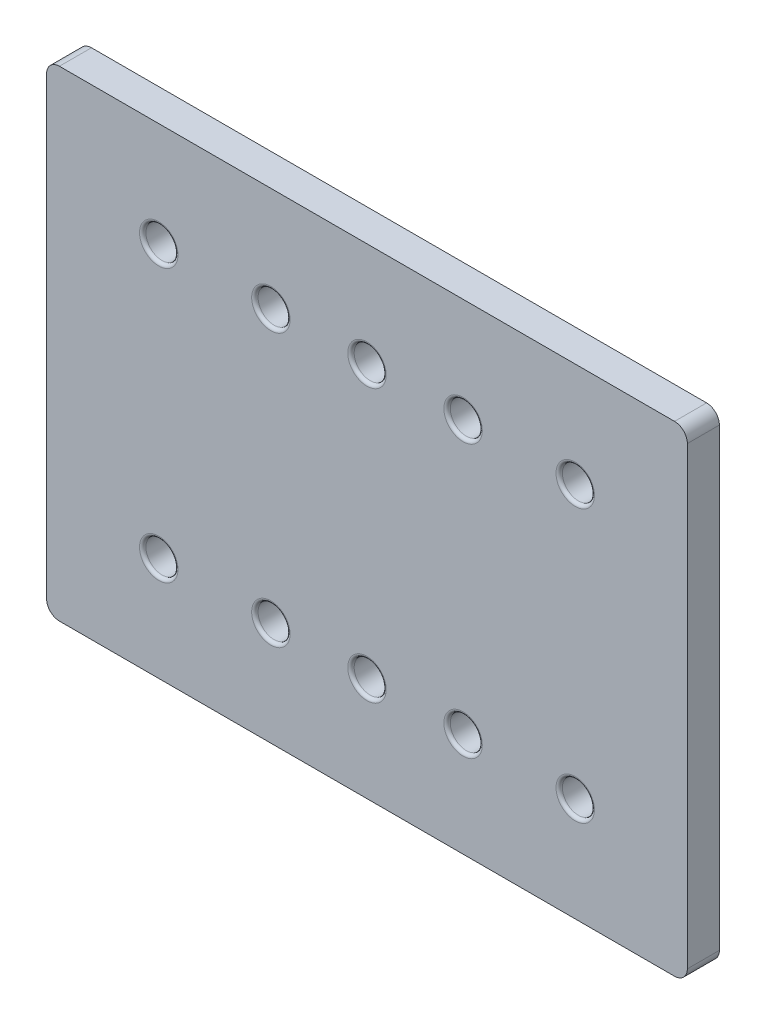
ISO-10303-21;
HEADER;
FILE_DESCRIPTION(('STEP AP214'),'2;1');
FILE_NAME('part.step','',(''),(''),'','','');
FILE_SCHEMA(('AUTOMOTIVE_DESIGN { 1 0 10303 214 1 1 1 1 }'));
ENDSEC;
DATA;
#1=APPLICATION_CONTEXT('core data for automotive mechanical design processes');
#2=APPLICATION_PROTOCOL_DEFINITION('international standard','automotive_design',2000,#1);
#3=PRODUCT_CONTEXT('',#1,'mechanical');
#4=PRODUCT('Part','Part','',(#3));
#5=PRODUCT_RELATED_PRODUCT_CATEGORY('part','',(#4));
#6=PRODUCT_DEFINITION_FORMATION('','',#4);
#7=PRODUCT_DEFINITION_CONTEXT('part definition',#1,'design');
#8=PRODUCT_DEFINITION('design','',#6,#7);
#9=PRODUCT_DEFINITION_SHAPE('','',#8);
#10=(LENGTH_UNIT() NAMED_UNIT(*) SI_UNIT(.MILLI.,.METRE.));
#11=(NAMED_UNIT(*) PLANE_ANGLE_UNIT() SI_UNIT($,.RADIAN.));
#12=(NAMED_UNIT(*) SI_UNIT($,.STERADIAN.) SOLID_ANGLE_UNIT());
#13=UNCERTAINTY_MEASURE_WITH_UNIT(LENGTH_MEASURE(1.E-05),#10,'distance_accuracy_value','');
#14=(GEOMETRIC_REPRESENTATION_CONTEXT(3) GLOBAL_UNCERTAINTY_ASSIGNED_CONTEXT((#13)) GLOBAL_UNIT_ASSIGNED_CONTEXT((#10,
#11,#12)) REPRESENTATION_CONTEXT('',''));
#15=CARTESIAN_POINT('',(0.,0.,0.));
#16=DIRECTION('',(0.,0.,1.));
#17=DIRECTION('',(1.,0.,0.));
#18=AXIS2_PLACEMENT_3D('',#15,#16,#17);
#19=CARTESIAN_POINT('',(250.,6.11266741651055E-13,1898.));
#20=DIRECTION('',(-1.,0.,0.));
#21=DIRECTION('',(0.,0.,1.));
#22=AXIS2_PLACEMENT_3D('',#19,#20,#21);
#23=PLANE('',#22);
#24=DIRECTION('',(0.,1.,0.));
#25=VECTOR('',#24,1.);
#26=CARTESIAN_POINT('',(250.,6.11266741651055E-13,1898.));
#27=LINE('',#26,#25);
#28=CARTESIAN_POINT('',(250.,86.9999999999996,1898.));
#29=VERTEX_POINT('',#28);
#30=CARTESIAN_POINT('',(250.,157.999999999999,1898.));
#31=VERTEX_POINT('',#30);
#32=EDGE_CURVE('E126',#29,#31,#27,.T.);
#33=ORIENTED_EDGE('',*,*,#32,.F.);
#34=DIRECTION('',(0.,0.,-1.));
#35=VECTOR('',#34,1.);
#36=CARTESIAN_POINT('',(250.,86.9999999999996,1893.));
#37=LINE('',#36,#35);
#38=CARTESIAN_POINT('',(250.,86.9999999999996,1893.));
#39=VERTEX_POINT('',#38);
#40=EDGE_CURVE('E110',#29,#39,#37,.T.);
#41=ORIENTED_EDGE('',*,*,#40,.T.);
#42=DIRECTION('',(0.,1.,0.));
#43=VECTOR('',#42,1.);
#44=CARTESIAN_POINT('',(250.,6.11266741651055E-13,1893.));
#45=LINE('',#44,#43);
#46=CARTESIAN_POINT('',(250.,157.999999999999,1893.));
#47=VERTEX_POINT('',#46);
#48=EDGE_CURVE('E123',#39,#47,#45,.T.);
#49=ORIENTED_EDGE('',*,*,#48,.T.);
#50=DIRECTION('',(0.,0.,-1.));
#51=VECTOR('',#50,1.);
#52=CARTESIAN_POINT('',(250.,157.999999999999,1898.));
#53=LINE('',#52,#51);
#54=EDGE_CURVE('E129',#47,#31,#53,.F.);
#55=ORIENTED_EDGE('',*,*,#54,.T.);
#56=EDGE_LOOP('',(#33,#41,#49,#55));
#57=FACE_BOUND('',#56,.T.);
#58=ADVANCED_FACE('F38',(#57),#23,.F.);
#59=CARTESIAN_POINT('',(215.,159.999999999999,1898.));
#60=DIRECTION('',(0.,-1.,0.));
#61=DIRECTION('',(0.,0.,-1.));
#62=AXIS2_PLACEMENT_3D('',#59,#60,#61);
#63=PLANE('',#62);
#64=DIRECTION('',(-1.,0.,0.));
#65=VECTOR('',#64,1.);
#66=CARTESIAN_POINT('',(215.,159.999999999999,1898.));
#67=LINE('',#66,#65);
#68=CARTESIAN_POINT('',(248.,159.999999999999,1898.));
#69=VERTEX_POINT('',#68);
#70=CARTESIAN_POINT('',(152.,159.999999999999,1898.));
#71=VERTEX_POINT('',#70);
#72=EDGE_CURVE('E495',#69,#71,#67,.T.);
#73=ORIENTED_EDGE('',*,*,#72,.F.);
#74=DIRECTION('',(0.,0.,-1.));
#75=VECTOR('',#74,1.);
#76=CARTESIAN_POINT('',(248.,159.999999999999,1898.));
#77=LINE('',#76,#75);
#78=CARTESIAN_POINT('',(248.,159.999999999999,1893.));
#79=VERTEX_POINT('',#78);
#80=EDGE_CURVE('E184',#69,#79,#77,.T.);
#81=ORIENTED_EDGE('',*,*,#80,.T.);
#82=DIRECTION('',(-1.,0.,0.));
#83=VECTOR('',#82,1.);
#84=CARTESIAN_POINT('',(215.,159.999999999999,1893.));
#85=LINE('',#84,#83);
#86=CARTESIAN_POINT('',(152.,159.999999999999,1893.));
#87=VERTEX_POINT('',#86);
#88=EDGE_CURVE('E135',#79,#87,#85,.T.);
#89=ORIENTED_EDGE('',*,*,#88,.T.);
#90=DIRECTION('',(0.,0.,-1.));
#91=VECTOR('',#90,1.);
#92=CARTESIAN_POINT('',(152.,159.999999999999,1898.));
#93=LINE('',#92,#91);
#94=EDGE_CURVE('E181',#87,#71,#93,.F.);
#95=ORIENTED_EDGE('',*,*,#94,.T.);
#96=EDGE_LOOP('',(#73,#81,#89,#95));
#97=FACE_BOUND('',#96,.T.);
#98=ADVANCED_FACE('F364',(#97),#63,.F.);
#99=CARTESIAN_POINT('',(150.,6.11266741651055E-13,1898.));
#100=DIRECTION('',(-1.,0.,0.));
#101=DIRECTION('',(0.,0.,1.));
#102=AXIS2_PLACEMENT_3D('',#99,#100,#101);
#103=PLANE('',#102);
#104=DIRECTION('',(0.,1.,0.));
#105=VECTOR('',#104,1.);
#106=CARTESIAN_POINT('',(150.,6.11266741651055E-13,1893.));
#107=LINE('',#106,#105);
#108=CARTESIAN_POINT('',(150.,86.9999999999996,1893.));
#109=VERTEX_POINT('',#108);
#110=CARTESIAN_POINT('',(150.,157.999999999999,1893.));
#111=VERTEX_POINT('',#110);
#112=EDGE_CURVE('E139',#109,#111,#107,.T.);
#113=ORIENTED_EDGE('',*,*,#112,.F.);
#114=DIRECTION('',(0.,0.,-1.));
#115=VECTOR('',#114,1.);
#116=CARTESIAN_POINT('',(150.,86.9999999999996,1898.));
#117=LINE('',#116,#115);
#118=CARTESIAN_POINT('',(150.,86.9999999999996,1898.));
#119=VERTEX_POINT('',#118);
#120=EDGE_CURVE('E61',#109,#119,#117,.F.);
#121=ORIENTED_EDGE('',*,*,#120,.T.);
#122=DIRECTION('',(0.,1.,0.));
#123=VECTOR('',#122,1.);
#124=CARTESIAN_POINT('',(150.,6.11266741651055E-13,1898.));
#125=LINE('',#124,#123);
#126=CARTESIAN_POINT('',(150.,157.999999999999,1898.));
#127=VERTEX_POINT('',#126);
#128=EDGE_CURVE('E493',#119,#127,#125,.T.);
#129=ORIENTED_EDGE('',*,*,#128,.T.);
#130=DIRECTION('',(0.,0.,-1.));
#131=VECTOR('',#130,1.);
#132=CARTESIAN_POINT('',(150.,157.999999999999,1893.));
#133=LINE('',#132,#131);
#134=EDGE_CURVE('E175',#127,#111,#133,.T.);
#135=ORIENTED_EDGE('',*,*,#134,.T.);
#136=EDGE_LOOP('',(#113,#121,#129,#135));
#137=FACE_BOUND('',#136,.T.);
#138=ADVANCED_FACE('F369',(#137),#103,.T.);
#139=CARTESIAN_POINT('',(215.,84.9999999999996,1898.));
#140=DIRECTION('',(0.,-1.,0.));
#141=DIRECTION('',(0.,0.,-1.));
#142=AXIS2_PLACEMENT_3D('',#139,#140,#141);
#143=PLANE('',#142);
#144=DIRECTION('',(-1.,0.,0.));
#145=VECTOR('',#144,1.);
#146=CARTESIAN_POINT('',(215.,84.9999999999996,1893.));
#147=LINE('',#146,#145);
#148=CARTESIAN_POINT('',(248.,84.9999999999996,1893.));
#149=VERTEX_POINT('',#148);
#150=CARTESIAN_POINT('',(152.,84.9999999999996,1893.));
#151=VERTEX_POINT('',#150);
#152=EDGE_CURVE('E148',#149,#151,#147,.T.);
#153=ORIENTED_EDGE('',*,*,#152,.F.);
#154=DIRECTION('',(0.,0.,-1.));
#155=VECTOR('',#154,1.);
#156=CARTESIAN_POINT('',(248.,84.9999999999996,1898.));
#157=LINE('',#156,#155);
#158=CARTESIAN_POINT('',(248.,84.9999999999996,1898.));
#159=VERTEX_POINT('',#158);
#160=EDGE_CURVE('E111',#149,#159,#157,.F.);
#161=ORIENTED_EDGE('',*,*,#160,.T.);
#162=DIRECTION('',(-1.,0.,0.));
#163=VECTOR('',#162,1.);
#164=CARTESIAN_POINT('',(215.,84.9999999999996,1898.));
#165=LINE('',#164,#163);
#166=CARTESIAN_POINT('',(152.,84.9999999999996,1898.));
#167=VERTEX_POINT('',#166);
#168=EDGE_CURVE('E142',#159,#167,#165,.T.);
#169=ORIENTED_EDGE('',*,*,#168,.T.);
#170=DIRECTION('',(0.,0.,-1.));
#171=VECTOR('',#170,1.);
#172=CARTESIAN_POINT('',(152.,84.9999999999996,1898.));
#173=LINE('',#172,#171);
#174=EDGE_CURVE('E117',#167,#151,#173,.T.);
#175=ORIENTED_EDGE('',*,*,#174,.T.);
#176=EDGE_LOOP('',(#153,#161,#169,#175));
#177=FACE_BOUND('',#176,.T.);
#178=ADVANCED_FACE('F474',(#177),#143,.T.);
#179=CARTESIAN_POINT('',(0.,0.,1898.));
#180=DIRECTION('',(0.,0.,1.));
#181=DIRECTION('',(1.,0.,0.));
#182=AXIS2_PLACEMENT_3D('',#179,#180,#181);
#183=PLANE('',#182);
#184=CARTESIAN_POINT('',(215.,143.749999999999,1898.));
#185=DIRECTION('',(0.,0.,1.));
#186=DIRECTION('',(1.,0.,0.));
#187=AXIS2_PLACEMENT_3D('',#184,#185,#186);
#188=CIRCLE('',#187,3.00000000000003);
#189=CARTESIAN_POINT('',(218.,143.749999999999,1898.));
#190=VERTEX_POINT('',#189);
#191=EDGE_CURVE('E11',#190,#190,#188,.F.);
#192=ORIENTED_EDGE('',*,*,#191,.T.);
#193=EDGE_LOOP('',(#192));
#194=FACE_BOUND('',#193,.T.);
#195=CARTESIAN_POINT('',(185.,143.749999999999,1898.));
#196=DIRECTION('',(0.,0.,1.));
#197=DIRECTION('',(1.,0.,0.));
#198=AXIS2_PLACEMENT_3D('',#195,#196,#197);
#199=CIRCLE('',#198,3.00000000000003);
#200=CARTESIAN_POINT('',(188.,143.749999999999,1898.));
#201=VERTEX_POINT('',#200);
#202=EDGE_CURVE('E47',#201,#201,#199,.F.);
#203=ORIENTED_EDGE('',*,*,#202,.T.);
#204=EDGE_LOOP('',(#203));
#205=FACE_BOUND('',#204,.T.);
#206=CARTESIAN_POINT('',(185.,101.249999999999,1898.));
#207=DIRECTION('',(0.,0.,1.));
#208=DIRECTION('',(1.,0.,0.));
#209=AXIS2_PLACEMENT_3D('',#206,#207,#208);
#210=CIRCLE('',#209,3.00000000000003);
#211=CARTESIAN_POINT('',(188.,101.249999999999,1898.));
#212=VERTEX_POINT('',#211);
#213=EDGE_CURVE('E336',#212,#212,#210,.F.);
#214=ORIENTED_EDGE('',*,*,#213,.T.);
#215=EDGE_LOOP('',(#214));
#216=FACE_BOUND('',#215,.T.);
#217=CARTESIAN_POINT('',(215.,101.249999999999,1898.));
#218=DIRECTION('',(0.,0.,1.));
#219=DIRECTION('',(1.,0.,0.));
#220=AXIS2_PLACEMENT_3D('',#217,#218,#219);
#221=CIRCLE('',#220,3.00000000000003);
#222=CARTESIAN_POINT('',(218.,101.249999999999,1898.));
#223=VERTEX_POINT('',#222);
#224=EDGE_CURVE('E332',#223,#223,#221,.F.);
#225=ORIENTED_EDGE('',*,*,#224,.T.);
#226=EDGE_LOOP('',(#225));
#227=FACE_BOUND('',#226,.T.);
#228=CARTESIAN_POINT('',(200.,101.249999999999,1898.));
#229=DIRECTION('',(0.,0.,1.));
#230=DIRECTION('',(1.,0.,0.));
#231=AXIS2_PLACEMENT_3D('',#228,#229,#230);
#232=CIRCLE('',#231,3.00000000000003);
#233=CARTESIAN_POINT('',(203.,101.249999999999,1898.));
#234=VERTEX_POINT('',#233);
#235=EDGE_CURVE('E328',#234,#234,#232,.F.);
#236=ORIENTED_EDGE('',*,*,#235,.T.);
#237=EDGE_LOOP('',(#236));
#238=FACE_BOUND('',#237,.T.);
#239=CARTESIAN_POINT('',(232.5,101.249999999999,1898.));
#240=DIRECTION('',(0.,0.,1.));
#241=DIRECTION('',(1.,0.,0.));
#242=AXIS2_PLACEMENT_3D('',#239,#240,#241);
#243=CIRCLE('',#242,2.99999999999991);
#244=CARTESIAN_POINT('',(235.5,101.249999999999,1898.));
#245=VERTEX_POINT('',#244);
#246=EDGE_CURVE('E324',#245,#245,#243,.F.);
#247=ORIENTED_EDGE('',*,*,#246,.T.);
#248=EDGE_LOOP('',(#247));
#249=FACE_BOUND('',#248,.T.);
#250=CARTESIAN_POINT('',(200.,143.749999999999,1898.));
#251=DIRECTION('',(0.,0.,1.));
#252=DIRECTION('',(1.,0.,0.));
#253=AXIS2_PLACEMENT_3D('',#250,#251,#252);
#254=CIRCLE('',#253,3.00000000000003);
#255=CARTESIAN_POINT('',(203.,143.749999999999,1898.));
#256=VERTEX_POINT('',#255);
#257=EDGE_CURVE('E320',#256,#256,#254,.F.);
#258=ORIENTED_EDGE('',*,*,#257,.T.);
#259=EDGE_LOOP('',(#258));
#260=FACE_BOUND('',#259,.T.);
#261=CARTESIAN_POINT('',(167.5,101.249999999999,1898.));
#262=DIRECTION('',(0.,0.,1.));
#263=DIRECTION('',(1.,0.,0.));
#264=AXIS2_PLACEMENT_3D('',#261,#262,#263);
#265=CIRCLE('',#264,2.99999999999991);
#266=CARTESIAN_POINT('',(170.5,101.249999999999,1898.));
#267=VERTEX_POINT('',#266);
#268=EDGE_CURVE('E316',#267,#267,#265,.F.);
#269=ORIENTED_EDGE('',*,*,#268,.T.);
#270=EDGE_LOOP('',(#269));
#271=FACE_BOUND('',#270,.T.);
#272=CARTESIAN_POINT('',(232.5,143.749999999999,1898.));
#273=DIRECTION('',(0.,0.,1.));
#274=DIRECTION('',(1.,0.,0.));
#275=AXIS2_PLACEMENT_3D('',#272,#273,#274);
#276=CIRCLE('',#275,2.99999999999991);
#277=CARTESIAN_POINT('',(235.5,143.749999999999,1898.));
#278=VERTEX_POINT('',#277);
#279=EDGE_CURVE('E312',#278,#278,#276,.F.);
#280=ORIENTED_EDGE('',*,*,#279,.T.);
#281=EDGE_LOOP('',(#280));
#282=FACE_BOUND('',#281,.T.);
#283=CARTESIAN_POINT('',(167.5,143.749999999999,1898.));
#284=DIRECTION('',(0.,0.,1.));
#285=DIRECTION('',(1.,0.,0.));
#286=AXIS2_PLACEMENT_3D('',#283,#284,#285);
#287=CIRCLE('',#286,2.99999999999991);
#288=CARTESIAN_POINT('',(170.5,143.749999999999,1898.));
#289=VERTEX_POINT('',#288);
#290=EDGE_CURVE('E308',#289,#289,#287,.F.);
#291=ORIENTED_EDGE('',*,*,#290,.T.);
#292=EDGE_LOOP('',(#291));
#293=FACE_BOUND('',#292,.T.);
#294=ORIENTED_EDGE('',*,*,#168,.F.);
#295=CARTESIAN_POINT('',(248.,86.9999999999996,1898.));
#296=DIRECTION('',(0.,0.,1.));
#297=DIRECTION('',(1.,0.,0.));
#298=AXIS2_PLACEMENT_3D('',#295,#296,#297);
#299=CIRCLE('',#298,2.);
#300=EDGE_CURVE('E172',#159,#29,#299,.T.);
#301=ORIENTED_EDGE('',*,*,#300,.T.);
#302=ORIENTED_EDGE('',*,*,#32,.T.);
#303=CARTESIAN_POINT('',(248.,157.999999999999,1898.));
#304=DIRECTION('',(0.,0.,1.));
#305=DIRECTION('',(1.,0.,0.));
#306=AXIS2_PLACEMENT_3D('',#303,#304,#305);
#307=CIRCLE('',#306,2.);
#308=EDGE_CURVE('E166',#31,#69,#307,.T.);
#309=ORIENTED_EDGE('',*,*,#308,.T.);
#310=ORIENTED_EDGE('',*,*,#72,.T.);
#311=CARTESIAN_POINT('',(152.,157.999999999999,1898.));
#312=DIRECTION('',(0.,0.,1.));
#313=DIRECTION('',(1.,0.,0.));
#314=AXIS2_PLACEMENT_3D('',#311,#312,#313);
#315=CIRCLE('',#314,2.);
#316=EDGE_CURVE('E54',#71,#127,#315,.T.);
#317=ORIENTED_EDGE('',*,*,#316,.T.);
#318=ORIENTED_EDGE('',*,*,#128,.F.);
#319=CARTESIAN_POINT('',(152.,86.9999999999996,1898.));
#320=DIRECTION('',(0.,0.,1.));
#321=DIRECTION('',(1.,0.,0.));
#322=AXIS2_PLACEMENT_3D('',#319,#320,#321);
#323=CIRCLE('',#322,2.);
#324=EDGE_CURVE('E169',#119,#167,#323,.T.);
#325=ORIENTED_EDGE('',*,*,#324,.T.);
#326=EDGE_LOOP('',(#294,#301,#302,#309,#310,#317,#318,#325));
#327=FACE_BOUND('',#326,.T.);
#328=ADVANCED_FACE('F343',(#194,#205,#216,#227,#238,#249,#260,#271,#282,#293,#327),#183,.T.);
#329=CARTESIAN_POINT('',(0.,0.,1893.));
#330=DIRECTION('',(0.,0.,1.));
#331=DIRECTION('',(1.,0.,0.));
#332=AXIS2_PLACEMENT_3D('',#329,#330,#331);
#333=PLANE('',#332);
#334=CARTESIAN_POINT('',(215.,143.749999999999,1893.));
#335=DIRECTION('',(0.,0.,1.));
#336=DIRECTION('',(1.,0.,0.));
#337=AXIS2_PLACEMENT_3D('',#334,#335,#336);
#338=CIRCLE('',#337,3.00000000000003);
#339=CARTESIAN_POINT('',(218.,143.749999999999,1893.));
#340=VERTEX_POINT('',#339);
#341=EDGE_CURVE('E232',#340,#340,#338,.T.);
#342=ORIENTED_EDGE('',*,*,#341,.T.);
#343=EDGE_LOOP('',(#342));
#344=FACE_BOUND('',#343,.T.);
#345=CARTESIAN_POINT('',(185.,143.749999999999,1893.));
#346=DIRECTION('',(0.,0.,1.));
#347=DIRECTION('',(1.,0.,0.));
#348=AXIS2_PLACEMENT_3D('',#345,#346,#347);
#349=CIRCLE('',#348,3.00000000000003);
#350=CARTESIAN_POINT('',(188.,143.749999999999,1893.));
#351=VERTEX_POINT('',#350);
#352=EDGE_CURVE('E228',#351,#351,#349,.T.);
#353=ORIENTED_EDGE('',*,*,#352,.T.);
#354=EDGE_LOOP('',(#353));
#355=FACE_BOUND('',#354,.T.);
#356=CARTESIAN_POINT('',(185.,101.249999999999,1893.));
#357=DIRECTION('',(0.,0.,1.));
#358=DIRECTION('',(1.,0.,0.));
#359=AXIS2_PLACEMENT_3D('',#356,#357,#358);
#360=CIRCLE('',#359,3.00000000000003);
#361=CARTESIAN_POINT('',(188.,101.249999999999,1893.));
#362=VERTEX_POINT('',#361);
#363=EDGE_CURVE('E224',#362,#362,#360,.T.);
#364=ORIENTED_EDGE('',*,*,#363,.T.);
#365=EDGE_LOOP('',(#364));
#366=FACE_BOUND('',#365,.T.);
#367=CARTESIAN_POINT('',(215.,101.249999999999,1893.));
#368=DIRECTION('',(0.,0.,1.));
#369=DIRECTION('',(1.,0.,0.));
#370=AXIS2_PLACEMENT_3D('',#367,#368,#369);
#371=CIRCLE('',#370,3.00000000000003);
#372=CARTESIAN_POINT('',(218.,101.249999999999,1893.));
#373=VERTEX_POINT('',#372);
#374=EDGE_CURVE('E220',#373,#373,#371,.T.);
#375=ORIENTED_EDGE('',*,*,#374,.T.);
#376=EDGE_LOOP('',(#375));
#377=FACE_BOUND('',#376,.T.);
#378=CARTESIAN_POINT('',(200.,101.249999999999,1893.));
#379=DIRECTION('',(0.,0.,1.));
#380=DIRECTION('',(1.,0.,0.));
#381=AXIS2_PLACEMENT_3D('',#378,#379,#380);
#382=CIRCLE('',#381,3.00000000000003);
#383=CARTESIAN_POINT('',(203.,101.249999999999,1893.));
#384=VERTEX_POINT('',#383);
#385=EDGE_CURVE('E216',#384,#384,#382,.T.);
#386=ORIENTED_EDGE('',*,*,#385,.T.);
#387=EDGE_LOOP('',(#386));
#388=FACE_BOUND('',#387,.T.);
#389=CARTESIAN_POINT('',(232.5,101.249999999999,1893.));
#390=DIRECTION('',(0.,0.,1.));
#391=DIRECTION('',(1.,0.,0.));
#392=AXIS2_PLACEMENT_3D('',#389,#390,#391);
#393=CIRCLE('',#392,2.99999999999991);
#394=CARTESIAN_POINT('',(235.5,101.249999999999,1893.));
#395=VERTEX_POINT('',#394);
#396=EDGE_CURVE('E212',#395,#395,#393,.T.);
#397=ORIENTED_EDGE('',*,*,#396,.T.);
#398=EDGE_LOOP('',(#397));
#399=FACE_BOUND('',#398,.T.);
#400=CARTESIAN_POINT('',(200.,143.749999999999,1893.));
#401=DIRECTION('',(0.,0.,1.));
#402=DIRECTION('',(1.,0.,0.));
#403=AXIS2_PLACEMENT_3D('',#400,#401,#402);
#404=CIRCLE('',#403,3.00000000000003);
#405=CARTESIAN_POINT('',(203.,143.749999999999,1893.));
#406=VERTEX_POINT('',#405);
#407=EDGE_CURVE('E208',#406,#406,#404,.T.);
#408=ORIENTED_EDGE('',*,*,#407,.T.);
#409=EDGE_LOOP('',(#408));
#410=FACE_BOUND('',#409,.T.);
#411=CARTESIAN_POINT('',(167.5,101.249999999999,1893.));
#412=DIRECTION('',(0.,0.,1.));
#413=DIRECTION('',(1.,0.,0.));
#414=AXIS2_PLACEMENT_3D('',#411,#412,#413);
#415=CIRCLE('',#414,2.99999999999991);
#416=CARTESIAN_POINT('',(170.5,101.249999999999,1893.));
#417=VERTEX_POINT('',#416);
#418=EDGE_CURVE('E204',#417,#417,#415,.T.);
#419=ORIENTED_EDGE('',*,*,#418,.T.);
#420=EDGE_LOOP('',(#419));
#421=FACE_BOUND('',#420,.T.);
#422=CARTESIAN_POINT('',(167.5,143.749999999999,1893.));
#423=DIRECTION('',(0.,0.,1.));
#424=DIRECTION('',(1.,0.,0.));
#425=AXIS2_PLACEMENT_3D('',#422,#423,#424);
#426=CIRCLE('',#425,2.99999999999991);
#427=CARTESIAN_POINT('',(170.5,143.749999999999,1893.));
#428=VERTEX_POINT('',#427);
#429=EDGE_CURVE('E200',#428,#428,#426,.T.);
#430=ORIENTED_EDGE('',*,*,#429,.T.);
#431=EDGE_LOOP('',(#430));
#432=FACE_BOUND('',#431,.T.);
#433=CARTESIAN_POINT('',(232.5,143.749999999999,1893.));
#434=DIRECTION('',(0.,0.,1.));
#435=DIRECTION('',(1.,0.,0.));
#436=AXIS2_PLACEMENT_3D('',#433,#434,#435);
#437=CIRCLE('',#436,2.99999999999991);
#438=CARTESIAN_POINT('',(235.5,143.749999999999,1893.));
#439=VERTEX_POINT('',#438);
#440=EDGE_CURVE('E196',#439,#439,#437,.T.);
#441=ORIENTED_EDGE('',*,*,#440,.T.);
#442=EDGE_LOOP('',(#441));
#443=FACE_BOUND('',#442,.T.);
#444=ORIENTED_EDGE('',*,*,#48,.F.);
#445=CARTESIAN_POINT('',(248.,86.9999999999996,1893.));
#446=DIRECTION('',(0.,0.,1.));
#447=DIRECTION('',(1.,0.,0.));
#448=AXIS2_PLACEMENT_3D('',#445,#446,#447);
#449=CIRCLE('',#448,2.);
#450=EDGE_CURVE('E106',#39,#149,#449,.F.);
#451=ORIENTED_EDGE('',*,*,#450,.T.);
#452=ORIENTED_EDGE('',*,*,#152,.T.);
#453=CARTESIAN_POINT('',(152.,86.9999999999996,1893.));
#454=DIRECTION('',(0.,0.,1.));
#455=DIRECTION('',(1.,0.,0.));
#456=AXIS2_PLACEMENT_3D('',#453,#454,#455);
#457=CIRCLE('',#456,2.);
#458=EDGE_CURVE('E118',#151,#109,#457,.F.);
#459=ORIENTED_EDGE('',*,*,#458,.T.);
#460=ORIENTED_EDGE('',*,*,#112,.T.);
#461=CARTESIAN_POINT('',(152.,157.999999999999,1893.));
#462=DIRECTION('',(0.,0.,1.));
#463=DIRECTION('',(1.,0.,0.));
#464=AXIS2_PLACEMENT_3D('',#461,#462,#463);
#465=CIRCLE('',#464,2.);
#466=EDGE_CURVE('E128',#111,#87,#465,.F.);
#467=ORIENTED_EDGE('',*,*,#466,.T.);
#468=ORIENTED_EDGE('',*,*,#88,.F.);
#469=CARTESIAN_POINT('',(248.,157.999999999999,1893.));
#470=DIRECTION('',(0.,0.,1.));
#471=DIRECTION('',(1.,0.,0.));
#472=AXIS2_PLACEMENT_3D('',#469,#470,#471);
#473=CIRCLE('',#472,2.);
#474=EDGE_CURVE('E133',#79,#47,#473,.F.);
#475=ORIENTED_EDGE('',*,*,#474,.T.);
#476=EDGE_LOOP('',(#444,#451,#452,#459,#460,#467,#468,#475));
#477=FACE_BOUND('',#476,.T.);
#478=ADVANCED_FACE('F131',(#344,#355,#366,#377,#388,#399,#410,#421,#432,#443,#477),#333,.F.);
#479=CARTESIAN_POINT('',(215.,143.749999999999,1898.));
#480=DIRECTION('',(0.,0.,-1.));
#481=DIRECTION('',(-1.,0.,0.));
#482=AXIS2_PLACEMENT_3D('',#479,#480,#481);
#483=CYLINDRICAL_SURFACE('',#482,2.50000000000003);
#484=CARTESIAN_POINT('',(215.,143.749999999999,1893.5));
#485=DIRECTION('',(0.,0.,1.));
#486=DIRECTION('',(1.,0.,0.));
#487=AXIS2_PLACEMENT_3D('',#484,#485,#486);
#488=CIRCLE('',#487,2.50000000000003);
#489=CARTESIAN_POINT('',(217.5,143.749999999999,1893.5));
#490=VERTEX_POINT('',#489);
#491=EDGE_CURVE('E192',#490,#490,#488,.F.);
#492=ORIENTED_EDGE('',*,*,#491,.T.);
#493=EDGE_LOOP('',(#492));
#494=FACE_BOUND('',#493,.T.);
#495=CARTESIAN_POINT('',(215.,143.749999999999,1897.5));
#496=DIRECTION('',(0.,0.,1.));
#497=DIRECTION('',(1.,0.,0.));
#498=AXIS2_PLACEMENT_3D('',#495,#496,#497);
#499=CIRCLE('',#498,2.50000000000003);
#500=CARTESIAN_POINT('',(217.5,143.749999999999,1897.5));
#501=VERTEX_POINT('',#500);
#502=EDGE_CURVE('E188',#501,#501,#499,.T.);
#503=ORIENTED_EDGE('',*,*,#502,.T.);
#504=EDGE_LOOP('',(#503));
#505=FACE_BOUND('',#504,.T.);
#506=ADVANCED_FACE('F513',(#494,#505),#483,.F.);
#507=CARTESIAN_POINT('',(185.,143.749999999999,1898.));
#508=DIRECTION('',(0.,0.,-1.));
#509=DIRECTION('',(-1.,0.,0.));
#510=AXIS2_PLACEMENT_3D('',#507,#508,#509);
#511=CYLINDRICAL_SURFACE('',#510,2.50000000000003);
#512=CARTESIAN_POINT('',(185.,143.749999999999,1893.5));
#513=DIRECTION('',(0.,0.,1.));
#514=DIRECTION('',(1.,0.,0.));
#515=AXIS2_PLACEMENT_3D('',#512,#513,#514);
#516=CIRCLE('',#515,2.50000000000003);
#517=CARTESIAN_POINT('',(187.5,143.749999999999,1893.5));
#518=VERTEX_POINT('',#517);
#519=EDGE_CURVE('E240',#518,#518,#516,.F.);
#520=ORIENTED_EDGE('',*,*,#519,.T.);
#521=EDGE_LOOP('',(#520));
#522=FACE_BOUND('',#521,.T.);
#523=CARTESIAN_POINT('',(185.,143.749999999999,1897.5));
#524=DIRECTION('',(0.,0.,1.));
#525=DIRECTION('',(1.,0.,0.));
#526=AXIS2_PLACEMENT_3D('',#523,#524,#525);
#527=CIRCLE('',#526,2.50000000000003);
#528=CARTESIAN_POINT('',(187.5,143.749999999999,1897.5));
#529=VERTEX_POINT('',#528);
#530=EDGE_CURVE('E236',#529,#529,#527,.T.);
#531=ORIENTED_EDGE('',*,*,#530,.T.);
#532=EDGE_LOOP('',(#531));
#533=FACE_BOUND('',#532,.T.);
#534=ADVANCED_FACE('F518',(#522,#533),#511,.F.);
#535=CARTESIAN_POINT('',(185.,101.249999999999,1898.));
#536=DIRECTION('',(0.,0.,-1.));
#537=DIRECTION('',(-1.,0.,0.));
#538=AXIS2_PLACEMENT_3D('',#535,#536,#537);
#539=CYLINDRICAL_SURFACE('',#538,2.50000000000003);
#540=CARTESIAN_POINT('',(185.,101.249999999999,1893.5));
#541=DIRECTION('',(0.,0.,1.));
#542=DIRECTION('',(1.,0.,0.));
#543=AXIS2_PLACEMENT_3D('',#540,#541,#542);
#544=CIRCLE('',#543,2.50000000000003);
#545=CARTESIAN_POINT('',(187.5,101.249999999999,1893.5));
#546=VERTEX_POINT('',#545);
#547=EDGE_CURVE('E248',#546,#546,#544,.F.);
#548=ORIENTED_EDGE('',*,*,#547,.T.);
#549=EDGE_LOOP('',(#548));
#550=FACE_BOUND('',#549,.T.);
#551=CARTESIAN_POINT('',(185.,101.249999999999,1897.5));
#552=DIRECTION('',(0.,0.,1.));
#553=DIRECTION('',(1.,0.,0.));
#554=AXIS2_PLACEMENT_3D('',#551,#552,#553);
#555=CIRCLE('',#554,2.50000000000003);
#556=CARTESIAN_POINT('',(187.5,101.249999999999,1897.5));
#557=VERTEX_POINT('',#556);
#558=EDGE_CURVE('E244',#557,#557,#555,.T.);
#559=ORIENTED_EDGE('',*,*,#558,.T.);
#560=EDGE_LOOP('',(#559));
#561=FACE_BOUND('',#560,.T.);
#562=ADVANCED_FACE('F522',(#550,#561),#539,.F.);
#563=CARTESIAN_POINT('',(215.,101.249999999999,1898.));
#564=DIRECTION('',(0.,0.,-1.));
#565=DIRECTION('',(-1.,0.,0.));
#566=AXIS2_PLACEMENT_3D('',#563,#564,#565);
#567=CYLINDRICAL_SURFACE('',#566,2.50000000000003);
#568=CARTESIAN_POINT('',(215.,101.249999999999,1893.5));
#569=DIRECTION('',(0.,0.,1.));
#570=DIRECTION('',(1.,0.,0.));
#571=AXIS2_PLACEMENT_3D('',#568,#569,#570);
#572=CIRCLE('',#571,2.50000000000003);
#573=CARTESIAN_POINT('',(217.5,101.249999999999,1893.5));
#574=VERTEX_POINT('',#573);
#575=EDGE_CURVE('E256',#574,#574,#572,.F.);
#576=ORIENTED_EDGE('',*,*,#575,.T.);
#577=EDGE_LOOP('',(#576));
#578=FACE_BOUND('',#577,.T.);
#579=CARTESIAN_POINT('',(215.,101.249999999999,1897.5));
#580=DIRECTION('',(0.,0.,1.));
#581=DIRECTION('',(1.,0.,0.));
#582=AXIS2_PLACEMENT_3D('',#579,#580,#581);
#583=CIRCLE('',#582,2.50000000000003);
#584=CARTESIAN_POINT('',(217.5,101.249999999999,1897.5));
#585=VERTEX_POINT('',#584);
#586=EDGE_CURVE('E252',#585,#585,#583,.T.);
#587=ORIENTED_EDGE('',*,*,#586,.T.);
#588=EDGE_LOOP('',(#587));
#589=FACE_BOUND('',#588,.T.);
#590=ADVANCED_FACE('F526',(#578,#589),#567,.F.);
#591=CARTESIAN_POINT('',(200.,101.249999999999,1885.92893218813));
#592=DIRECTION('',(0.,0.,1.));
#593=DIRECTION('',(1.,0.,0.));
#594=AXIS2_PLACEMENT_3D('',#591,#592,#593);
#595=CYLINDRICAL_SURFACE('',#594,2.50000000000003);
#596=CARTESIAN_POINT('',(200.,101.249999999999,1893.5));
#597=DIRECTION('',(0.,0.,1.));
#598=DIRECTION('',(1.,0.,0.));
#599=AXIS2_PLACEMENT_3D('',#596,#597,#598);
#600=CIRCLE('',#599,2.50000000000003);
#601=CARTESIAN_POINT('',(202.5,101.249999999999,1893.5));
#602=VERTEX_POINT('',#601);
#603=EDGE_CURVE('E264',#602,#602,#600,.F.);
#604=ORIENTED_EDGE('',*,*,#603,.T.);
#605=EDGE_LOOP('',(#604));
#606=FACE_BOUND('',#605,.T.);
#607=CARTESIAN_POINT('',(200.,101.249999999999,1897.5));
#608=DIRECTION('',(0.,0.,1.));
#609=DIRECTION('',(1.,0.,0.));
#610=AXIS2_PLACEMENT_3D('',#607,#608,#609);
#611=CIRCLE('',#610,2.50000000000003);
#612=CARTESIAN_POINT('',(202.5,101.249999999999,1897.5));
#613=VERTEX_POINT('',#612);
#614=EDGE_CURVE('E260',#613,#613,#611,.T.);
#615=ORIENTED_EDGE('',*,*,#614,.T.);
#616=EDGE_LOOP('',(#615));
#617=FACE_BOUND('',#616,.T.);
#618=ADVANCED_FACE('F530',(#606,#617),#595,.F.);
#619=CARTESIAN_POINT('',(232.5,101.249999999999,1885.92893218813));
#620=DIRECTION('',(0.,0.,1.));
#621=DIRECTION('',(1.,0.,0.));
#622=AXIS2_PLACEMENT_3D('',#619,#620,#621);
#623=CYLINDRICAL_SURFACE('',#622,2.49999999999991);
#624=CARTESIAN_POINT('',(232.5,101.249999999999,1893.5));
#625=DIRECTION('',(0.,0.,1.));
#626=DIRECTION('',(1.,0.,0.));
#627=AXIS2_PLACEMENT_3D('',#624,#625,#626);
#628=CIRCLE('',#627,2.49999999999991);
#629=CARTESIAN_POINT('',(235.,101.249999999999,1893.5));
#630=VERTEX_POINT('',#629);
#631=EDGE_CURVE('E272',#630,#630,#628,.F.);
#632=ORIENTED_EDGE('',*,*,#631,.T.);
#633=EDGE_LOOP('',(#632));
#634=FACE_BOUND('',#633,.T.);
#635=CARTESIAN_POINT('',(232.5,101.249999999999,1897.5));
#636=DIRECTION('',(0.,0.,1.));
#637=DIRECTION('',(1.,0.,0.));
#638=AXIS2_PLACEMENT_3D('',#635,#636,#637);
#639=CIRCLE('',#638,2.49999999999991);
#640=CARTESIAN_POINT('',(235.,101.249999999999,1897.5));
#641=VERTEX_POINT('',#640);
#642=EDGE_CURVE('E268',#641,#641,#639,.T.);
#643=ORIENTED_EDGE('',*,*,#642,.T.);
#644=EDGE_LOOP('',(#643));
#645=FACE_BOUND('',#644,.T.);
#646=ADVANCED_FACE('F534',(#634,#645),#623,.F.);
#647=CARTESIAN_POINT('',(200.,143.749999999999,1885.92893218813));
#648=DIRECTION('',(0.,0.,1.));
#649=DIRECTION('',(1.,0.,0.));
#650=AXIS2_PLACEMENT_3D('',#647,#648,#649);
#651=CYLINDRICAL_SURFACE('',#650,2.50000000000003);
#652=CARTESIAN_POINT('',(200.,143.749999999999,1893.5));
#653=DIRECTION('',(0.,0.,1.));
#654=DIRECTION('',(1.,0.,0.));
#655=AXIS2_PLACEMENT_3D('',#652,#653,#654);
#656=CIRCLE('',#655,2.50000000000003);
#657=CARTESIAN_POINT('',(202.5,143.749999999999,1893.5));
#658=VERTEX_POINT('',#657);
#659=EDGE_CURVE('E280',#658,#658,#656,.F.);
#660=ORIENTED_EDGE('',*,*,#659,.T.);
#661=EDGE_LOOP('',(#660));
#662=FACE_BOUND('',#661,.T.);
#663=CARTESIAN_POINT('',(200.,143.749999999999,1897.5));
#664=DIRECTION('',(0.,0.,1.));
#665=DIRECTION('',(1.,0.,0.));
#666=AXIS2_PLACEMENT_3D('',#663,#664,#665);
#667=CIRCLE('',#666,2.50000000000003);
#668=CARTESIAN_POINT('',(202.5,143.749999999999,1897.5));
#669=VERTEX_POINT('',#668);
#670=EDGE_CURVE('E276',#669,#669,#667,.T.);
#671=ORIENTED_EDGE('',*,*,#670,.T.);
#672=EDGE_LOOP('',(#671));
#673=FACE_BOUND('',#672,.T.);
#674=ADVANCED_FACE('F539',(#662,#673),#651,.F.);
#675=CARTESIAN_POINT('',(167.5,101.249999999999,1885.92893218813));
#676=DIRECTION('',(0.,0.,1.));
#677=DIRECTION('',(1.,0.,0.));
#678=AXIS2_PLACEMENT_3D('',#675,#676,#677);
#679=CYLINDRICAL_SURFACE('',#678,2.49999999999991);
#680=CARTESIAN_POINT('',(167.5,101.249999999999,1893.5));
#681=DIRECTION('',(0.,0.,1.));
#682=DIRECTION('',(1.,0.,0.));
#683=AXIS2_PLACEMENT_3D('',#680,#681,#682);
#684=CIRCLE('',#683,2.49999999999991);
#685=CARTESIAN_POINT('',(170.,101.249999999999,1893.5));
#686=VERTEX_POINT('',#685);
#687=EDGE_CURVE('E288',#686,#686,#684,.F.);
#688=ORIENTED_EDGE('',*,*,#687,.T.);
#689=EDGE_LOOP('',(#688));
#690=FACE_BOUND('',#689,.T.);
#691=CARTESIAN_POINT('',(167.5,101.249999999999,1897.5));
#692=DIRECTION('',(0.,0.,1.));
#693=DIRECTION('',(1.,0.,0.));
#694=AXIS2_PLACEMENT_3D('',#691,#692,#693);
#695=CIRCLE('',#694,2.49999999999991);
#696=CARTESIAN_POINT('',(170.,101.249999999999,1897.5));
#697=VERTEX_POINT('',#696);
#698=EDGE_CURVE('E284',#697,#697,#695,.T.);
#699=ORIENTED_EDGE('',*,*,#698,.T.);
#700=EDGE_LOOP('',(#699));
#701=FACE_BOUND('',#700,.T.);
#702=ADVANCED_FACE('F536',(#690,#701),#679,.F.);
#703=CARTESIAN_POINT('',(167.5,143.749999999999,1885.92893218813));
#704=DIRECTION('',(0.,0.,1.));
#705=DIRECTION('',(1.,0.,0.));
#706=AXIS2_PLACEMENT_3D('',#703,#704,#705);
#707=CYLINDRICAL_SURFACE('',#706,2.49999999999991);
#708=CARTESIAN_POINT('',(167.5,143.749999999999,1893.5));
#709=DIRECTION('',(0.,0.,1.));
#710=DIRECTION('',(1.,0.,0.));
#711=AXIS2_PLACEMENT_3D('',#708,#709,#710);
#712=CIRCLE('',#711,2.49999999999991);
#713=CARTESIAN_POINT('',(170.,143.749999999999,1893.5));
#714=VERTEX_POINT('',#713);
#715=EDGE_CURVE('E296',#714,#714,#712,.F.);
#716=ORIENTED_EDGE('',*,*,#715,.T.);
#717=EDGE_LOOP('',(#716));
#718=FACE_BOUND('',#717,.T.);
#719=CARTESIAN_POINT('',(167.5,143.749999999999,1897.5));
#720=DIRECTION('',(0.,0.,1.));
#721=DIRECTION('',(1.,0.,0.));
#722=AXIS2_PLACEMENT_3D('',#719,#720,#721);
#723=CIRCLE('',#722,2.49999999999991);
#724=CARTESIAN_POINT('',(170.,143.749999999999,1897.5));
#725=VERTEX_POINT('',#724);
#726=EDGE_CURVE('E292',#725,#725,#723,.T.);
#727=ORIENTED_EDGE('',*,*,#726,.T.);
#728=EDGE_LOOP('',(#727));
#729=FACE_BOUND('',#728,.T.);
#730=ADVANCED_FACE('F435',(#718,#729),#707,.F.);
#731=CARTESIAN_POINT('',(232.5,143.749999999999,1885.92893218813));
#732=DIRECTION('',(0.,0.,1.));
#733=DIRECTION('',(1.,0.,0.));
#734=AXIS2_PLACEMENT_3D('',#731,#732,#733);
#735=CYLINDRICAL_SURFACE('',#734,2.49999999999991);
#736=CARTESIAN_POINT('',(232.5,143.749999999999,1893.5));
#737=DIRECTION('',(0.,0.,1.));
#738=DIRECTION('',(1.,0.,0.));
#739=AXIS2_PLACEMENT_3D('',#736,#737,#738);
#740=CIRCLE('',#739,2.49999999999991);
#741=CARTESIAN_POINT('',(235.,143.749999999999,1893.5));
#742=VERTEX_POINT('',#741);
#743=EDGE_CURVE('E304',#742,#742,#740,.F.);
#744=ORIENTED_EDGE('',*,*,#743,.T.);
#745=EDGE_LOOP('',(#744));
#746=FACE_BOUND('',#745,.T.);
#747=CARTESIAN_POINT('',(232.5,143.749999999999,1897.5));
#748=DIRECTION('',(0.,0.,1.));
#749=DIRECTION('',(1.,0.,0.));
#750=AXIS2_PLACEMENT_3D('',#747,#748,#749);
#751=CIRCLE('',#750,2.49999999999991);
#752=CARTESIAN_POINT('',(235.,143.749999999999,1897.5));
#753=VERTEX_POINT('',#752);
#754=EDGE_CURVE('E300',#753,#753,#751,.T.);
#755=ORIENTED_EDGE('',*,*,#754,.T.);
#756=EDGE_LOOP('',(#755));
#757=FACE_BOUND('',#756,.T.);
#758=ADVANCED_FACE('F377',(#746,#757),#735,.F.);
#759=CARTESIAN_POINT('',(248.,86.9999999999996,1898.));
#760=DIRECTION('',(0.,0.,1.));
#761=DIRECTION('',(1.,0.,0.));
#762=AXIS2_PLACEMENT_3D('',#759,#760,#761);
#763=CYLINDRICAL_SURFACE('',#762,2.);
#764=ORIENTED_EDGE('',*,*,#300,.F.);
#765=ORIENTED_EDGE('',*,*,#160,.F.);
#766=ORIENTED_EDGE('',*,*,#450,.F.);
#767=ORIENTED_EDGE('',*,*,#40,.F.);
#768=EDGE_LOOP('',(#764,#765,#766,#767));
#769=FACE_BOUND('',#768,.T.);
#770=ADVANCED_FACE('F109',(#769),#763,.T.);
#771=CARTESIAN_POINT('',(152.,86.9999999999996,1898.));
#772=DIRECTION('',(0.,0.,-1.));
#773=DIRECTION('',(-1.,0.,0.));
#774=AXIS2_PLACEMENT_3D('',#771,#772,#773);
#775=CYLINDRICAL_SURFACE('',#774,2.);
#776=ORIENTED_EDGE('',*,*,#324,.F.);
#777=ORIENTED_EDGE('',*,*,#120,.F.);
#778=ORIENTED_EDGE('',*,*,#458,.F.);
#779=ORIENTED_EDGE('',*,*,#174,.F.);
#780=EDGE_LOOP('',(#776,#777,#778,#779));
#781=FACE_BOUND('',#780,.T.);
#782=ADVANCED_FACE('F376',(#781),#775,.T.);
#783=CARTESIAN_POINT('',(248.,157.999999999999,1898.));
#784=DIRECTION('',(0.,0.,-1.));
#785=DIRECTION('',(-1.,0.,0.));
#786=AXIS2_PLACEMENT_3D('',#783,#784,#785);
#787=CYLINDRICAL_SURFACE('',#786,2.);
#788=ORIENTED_EDGE('',*,*,#308,.F.);
#789=ORIENTED_EDGE('',*,*,#54,.F.);
#790=ORIENTED_EDGE('',*,*,#474,.F.);
#791=ORIENTED_EDGE('',*,*,#80,.F.);
#792=EDGE_LOOP('',(#788,#789,#790,#791));
#793=FACE_BOUND('',#792,.T.);
#794=ADVANCED_FACE('F380',(#793),#787,.T.);
#795=CARTESIAN_POINT('',(152.,157.999999999999,1898.));
#796=DIRECTION('',(0.,0.,1.));
#797=DIRECTION('',(1.,0.,0.));
#798=AXIS2_PLACEMENT_3D('',#795,#796,#797);
#799=CYLINDRICAL_SURFACE('',#798,2.);
#800=ORIENTED_EDGE('',*,*,#316,.F.);
#801=ORIENTED_EDGE('',*,*,#94,.F.);
#802=ORIENTED_EDGE('',*,*,#466,.F.);
#803=ORIENTED_EDGE('',*,*,#134,.F.);
#804=EDGE_LOOP('',(#800,#801,#802,#803));
#805=FACE_BOUND('',#804,.T.);
#806=ADVANCED_FACE('F384',(#805),#799,.T.);
#807=CARTESIAN_POINT('',(215.,143.749999999999,1893.5));
#808=DIRECTION('',(0.,0.,1.));
#809=DIRECTION('',(1.,0.,0.));
#810=AXIS2_PLACEMENT_3D('',#807,#808,#809);
#811=TOROIDAL_SURFACE('',#810,3.00000000000003,0.5);
#812=ORIENTED_EDGE('',*,*,#341,.F.);
#813=EDGE_LOOP('',(#812));
#814=FACE_BOUND('',#813,.T.);
#815=ORIENTED_EDGE('',*,*,#491,.F.);
#816=EDGE_LOOP('',(#815));
#817=FACE_BOUND('',#816,.T.);
#818=ADVANCED_FACE('F388',(#814,#817),#811,.T.);
#819=CARTESIAN_POINT('',(185.,143.749999999999,1893.5));
#820=DIRECTION('',(0.,0.,1.));
#821=DIRECTION('',(1.,0.,0.));
#822=AXIS2_PLACEMENT_3D('',#819,#820,#821);
#823=TOROIDAL_SURFACE('',#822,3.00000000000003,0.5);
#824=ORIENTED_EDGE('',*,*,#352,.F.);
#825=EDGE_LOOP('',(#824));
#826=FACE_BOUND('',#825,.T.);
#827=ORIENTED_EDGE('',*,*,#519,.F.);
#828=EDGE_LOOP('',(#827));
#829=FACE_BOUND('',#828,.T.);
#830=ADVANCED_FACE('F392',(#826,#829),#823,.T.);
#831=CARTESIAN_POINT('',(185.,101.249999999999,1893.5));
#832=DIRECTION('',(0.,0.,1.));
#833=DIRECTION('',(1.,0.,0.));
#834=AXIS2_PLACEMENT_3D('',#831,#832,#833);
#835=TOROIDAL_SURFACE('',#834,3.00000000000003,0.5);
#836=ORIENTED_EDGE('',*,*,#363,.F.);
#837=EDGE_LOOP('',(#836));
#838=FACE_BOUND('',#837,.T.);
#839=ORIENTED_EDGE('',*,*,#547,.F.);
#840=EDGE_LOOP('',(#839));
#841=FACE_BOUND('',#840,.T.);
#842=ADVANCED_FACE('F396',(#838,#841),#835,.T.);
#843=CARTESIAN_POINT('',(215.,101.249999999999,1893.5));
#844=DIRECTION('',(0.,0.,1.));
#845=DIRECTION('',(1.,0.,0.));
#846=AXIS2_PLACEMENT_3D('',#843,#844,#845);
#847=TOROIDAL_SURFACE('',#846,3.00000000000003,0.5);
#848=ORIENTED_EDGE('',*,*,#374,.F.);
#849=EDGE_LOOP('',(#848));
#850=FACE_BOUND('',#849,.T.);
#851=ORIENTED_EDGE('',*,*,#575,.F.);
#852=EDGE_LOOP('',(#851));
#853=FACE_BOUND('',#852,.T.);
#854=ADVANCED_FACE('F400',(#850,#853),#847,.T.);
#855=CARTESIAN_POINT('',(200.,101.249999999999,1893.5));
#856=DIRECTION('',(0.,0.,1.));
#857=DIRECTION('',(1.,0.,0.));
#858=AXIS2_PLACEMENT_3D('',#855,#856,#857);
#859=TOROIDAL_SURFACE('',#858,3.00000000000003,0.5);
#860=ORIENTED_EDGE('',*,*,#385,.F.);
#861=EDGE_LOOP('',(#860));
#862=FACE_BOUND('',#861,.T.);
#863=ORIENTED_EDGE('',*,*,#603,.F.);
#864=EDGE_LOOP('',(#863));
#865=FACE_BOUND('',#864,.T.);
#866=ADVANCED_FACE('F404',(#862,#865),#859,.T.);
#867=CARTESIAN_POINT('',(232.5,101.249999999999,1893.5));
#868=DIRECTION('',(0.,0.,1.));
#869=DIRECTION('',(1.,0.,0.));
#870=AXIS2_PLACEMENT_3D('',#867,#868,#869);
#871=TOROIDAL_SURFACE('',#870,2.99999999999991,0.5);
#872=ORIENTED_EDGE('',*,*,#396,.F.);
#873=EDGE_LOOP('',(#872));
#874=FACE_BOUND('',#873,.T.);
#875=ORIENTED_EDGE('',*,*,#631,.F.);
#876=EDGE_LOOP('',(#875));
#877=FACE_BOUND('',#876,.T.);
#878=ADVANCED_FACE('F408',(#874,#877),#871,.T.);
#879=CARTESIAN_POINT('',(200.,143.749999999999,1893.5));
#880=DIRECTION('',(0.,0.,1.));
#881=DIRECTION('',(1.,0.,0.));
#882=AXIS2_PLACEMENT_3D('',#879,#880,#881);
#883=TOROIDAL_SURFACE('',#882,3.00000000000003,0.5);
#884=ORIENTED_EDGE('',*,*,#407,.F.);
#885=EDGE_LOOP('',(#884));
#886=FACE_BOUND('',#885,.T.);
#887=ORIENTED_EDGE('',*,*,#659,.F.);
#888=EDGE_LOOP('',(#887));
#889=FACE_BOUND('',#888,.T.);
#890=ADVANCED_FACE('F412',(#886,#889),#883,.T.);
#891=CARTESIAN_POINT('',(167.5,101.249999999999,1893.5));
#892=DIRECTION('',(0.,0.,1.));
#893=DIRECTION('',(1.,0.,0.));
#894=AXIS2_PLACEMENT_3D('',#891,#892,#893);
#895=TOROIDAL_SURFACE('',#894,2.99999999999991,0.5);
#896=ORIENTED_EDGE('',*,*,#418,.F.);
#897=EDGE_LOOP('',(#896));
#898=FACE_BOUND('',#897,.T.);
#899=ORIENTED_EDGE('',*,*,#687,.F.);
#900=EDGE_LOOP('',(#899));
#901=FACE_BOUND('',#900,.T.);
#902=ADVANCED_FACE('F416',(#898,#901),#895,.T.);
#903=CARTESIAN_POINT('',(167.5,143.749999999999,1893.5));
#904=DIRECTION('',(0.,0.,1.));
#905=DIRECTION('',(1.,0.,0.));
#906=AXIS2_PLACEMENT_3D('',#903,#904,#905);
#907=TOROIDAL_SURFACE('',#906,2.99999999999991,0.5);
#908=ORIENTED_EDGE('',*,*,#429,.F.);
#909=EDGE_LOOP('',(#908));
#910=FACE_BOUND('',#909,.T.);
#911=ORIENTED_EDGE('',*,*,#715,.F.);
#912=EDGE_LOOP('',(#911));
#913=FACE_BOUND('',#912,.T.);
#914=ADVANCED_FACE('F420',(#910,#913),#907,.T.);
#915=CARTESIAN_POINT('',(232.5,143.749999999999,1893.5));
#916=DIRECTION('',(0.,0.,1.));
#917=DIRECTION('',(1.,0.,0.));
#918=AXIS2_PLACEMENT_3D('',#915,#916,#917);
#919=TOROIDAL_SURFACE('',#918,2.99999999999991,0.5);
#920=ORIENTED_EDGE('',*,*,#440,.F.);
#921=EDGE_LOOP('',(#920));
#922=FACE_BOUND('',#921,.T.);
#923=ORIENTED_EDGE('',*,*,#743,.F.);
#924=EDGE_LOOP('',(#923));
#925=FACE_BOUND('',#924,.T.);
#926=ADVANCED_FACE('F359',(#922,#925),#919,.T.);
#927=CARTESIAN_POINT('',(215.,143.749999999999,1897.5));
#928=DIRECTION('',(0.,0.,1.));
#929=DIRECTION('',(1.,0.,0.));
#930=AXIS2_PLACEMENT_3D('',#927,#928,#929);
#931=TOROIDAL_SURFACE('',#930,3.00000000000003,0.5);
#932=ORIENTED_EDGE('',*,*,#502,.F.);
#933=EDGE_LOOP('',(#932));
#934=FACE_BOUND('',#933,.T.);
#935=ORIENTED_EDGE('',*,*,#191,.F.);
#936=EDGE_LOOP('',(#935));
#937=FACE_BOUND('',#936,.T.);
#938=ADVANCED_FACE('F349',(#934,#937),#931,.T.);
#939=CARTESIAN_POINT('',(185.,143.749999999999,1897.5));
#940=DIRECTION('',(0.,0.,1.));
#941=DIRECTION('',(1.,0.,0.));
#942=AXIS2_PLACEMENT_3D('',#939,#940,#941);
#943=TOROIDAL_SURFACE('',#942,3.00000000000003,0.5);
#944=ORIENTED_EDGE('',*,*,#530,.F.);
#945=EDGE_LOOP('',(#944));
#946=FACE_BOUND('',#945,.T.);
#947=ORIENTED_EDGE('',*,*,#202,.F.);
#948=EDGE_LOOP('',(#947));
#949=FACE_BOUND('',#948,.T.);
#950=ADVANCED_FACE('F346',(#946,#949),#943,.T.);
#951=CARTESIAN_POINT('',(185.,101.249999999999,1897.5));
#952=DIRECTION('',(0.,0.,1.));
#953=DIRECTION('',(1.,0.,0.));
#954=AXIS2_PLACEMENT_3D('',#951,#952,#953);
#955=TOROIDAL_SURFACE('',#954,3.00000000000003,0.5);
#956=ORIENTED_EDGE('',*,*,#558,.F.);
#957=EDGE_LOOP('',(#956));
#958=FACE_BOUND('',#957,.T.);
#959=ORIENTED_EDGE('',*,*,#213,.F.);
#960=EDGE_LOOP('',(#959));
#961=FACE_BOUND('',#960,.T.);
#962=ADVANCED_FACE('F348',(#958,#961),#955,.T.);
#963=CARTESIAN_POINT('',(215.,101.249999999999,1897.5));
#964=DIRECTION('',(0.,0.,1.));
#965=DIRECTION('',(1.,0.,0.));
#966=AXIS2_PLACEMENT_3D('',#963,#964,#965);
#967=TOROIDAL_SURFACE('',#966,3.00000000000003,0.5);
#968=ORIENTED_EDGE('',*,*,#586,.F.);
#969=EDGE_LOOP('',(#968));
#970=FACE_BOUND('',#969,.T.);
#971=ORIENTED_EDGE('',*,*,#224,.F.);
#972=EDGE_LOOP('',(#971));
#973=FACE_BOUND('',#972,.T.);
#974=ADVANCED_FACE('F356',(#970,#973),#967,.T.);
#975=CARTESIAN_POINT('',(200.,101.249999999999,1897.5));
#976=DIRECTION('',(0.,0.,1.));
#977=DIRECTION('',(1.,0.,0.));
#978=AXIS2_PLACEMENT_3D('',#975,#976,#977);
#979=TOROIDAL_SURFACE('',#978,3.00000000000003,0.5);
#980=ORIENTED_EDGE('',*,*,#235,.F.);
#981=EDGE_LOOP('',(#980));
#982=FACE_BOUND('',#981,.T.);
#983=ORIENTED_EDGE('',*,*,#614,.F.);
#984=EDGE_LOOP('',(#983));
#985=FACE_BOUND('',#984,.T.);
#986=ADVANCED_FACE('F459',(#982,#985),#979,.T.);
#987=CARTESIAN_POINT('',(232.5,101.249999999999,1897.5));
#988=DIRECTION('',(0.,0.,1.));
#989=DIRECTION('',(1.,0.,0.));
#990=AXIS2_PLACEMENT_3D('',#987,#988,#989);
#991=TOROIDAL_SURFACE('',#990,2.99999999999991,0.5);
#992=ORIENTED_EDGE('',*,*,#246,.F.);
#993=EDGE_LOOP('',(#992));
#994=FACE_BOUND('',#993,.T.);
#995=ORIENTED_EDGE('',*,*,#642,.F.);
#996=EDGE_LOOP('',(#995));
#997=FACE_BOUND('',#996,.T.);
#998=ADVANCED_FACE('F455',(#994,#997),#991,.T.);
#999=CARTESIAN_POINT('',(200.,143.749999999999,1897.5));
#1000=DIRECTION('',(0.,0.,1.));
#1001=DIRECTION('',(1.,0.,0.));
#1002=AXIS2_PLACEMENT_3D('',#999,#1000,#1001);
#1003=TOROIDAL_SURFACE('',#1002,3.00000000000003,0.5);
#1004=ORIENTED_EDGE('',*,*,#257,.F.);
#1005=EDGE_LOOP('',(#1004));
#1006=FACE_BOUND('',#1005,.T.);
#1007=ORIENTED_EDGE('',*,*,#670,.F.);
#1008=EDGE_LOOP('',(#1007));
#1009=FACE_BOUND('',#1008,.T.);
#1010=ADVANCED_FACE('F448',(#1006,#1009),#1003,.T.);
#1011=CARTESIAN_POINT('',(167.5,101.249999999999,1897.5));
#1012=DIRECTION('',(0.,0.,1.));
#1013=DIRECTION('',(1.,0.,0.));
#1014=AXIS2_PLACEMENT_3D('',#1011,#1012,#1013);
#1015=TOROIDAL_SURFACE('',#1014,2.99999999999991,0.5);
#1016=ORIENTED_EDGE('',*,*,#268,.F.);
#1017=EDGE_LOOP('',(#1016));
#1018=FACE_BOUND('',#1017,.T.);
#1019=ORIENTED_EDGE('',*,*,#698,.F.);
#1020=EDGE_LOOP('',(#1019));
#1021=FACE_BOUND('',#1020,.T.);
#1022=ADVANCED_FACE('F441',(#1018,#1021),#1015,.T.);
#1023=CARTESIAN_POINT('',(232.5,143.749999999999,1897.5));
#1024=DIRECTION('',(0.,0.,1.));
#1025=DIRECTION('',(1.,0.,0.));
#1026=AXIS2_PLACEMENT_3D('',#1023,#1024,#1025);
#1027=TOROIDAL_SURFACE('',#1026,2.99999999999991,0.5);
#1028=ORIENTED_EDGE('',*,*,#279,.F.);
#1029=EDGE_LOOP('',(#1028));
#1030=FACE_BOUND('',#1029,.T.);
#1031=ORIENTED_EDGE('',*,*,#754,.F.);
#1032=EDGE_LOOP('',(#1031));
#1033=FACE_BOUND('',#1032,.T.);
#1034=ADVANCED_FACE('F439',(#1030,#1033),#1027,.T.);
#1035=CARTESIAN_POINT('',(167.5,143.749999999999,1897.5));
#1036=DIRECTION('',(0.,0.,1.));
#1037=DIRECTION('',(1.,0.,0.));
#1038=AXIS2_PLACEMENT_3D('',#1035,#1036,#1037);
#1039=TOROIDAL_SURFACE('',#1038,2.99999999999991,0.5);
#1040=ORIENTED_EDGE('',*,*,#290,.F.);
#1041=EDGE_LOOP('',(#1040));
#1042=FACE_BOUND('',#1041,.T.);
#1043=ORIENTED_EDGE('',*,*,#726,.F.);
#1044=EDGE_LOOP('',(#1043));
#1045=FACE_BOUND('',#1044,.T.);
#1046=ADVANCED_FACE('F40',(#1042,#1045),#1039,.T.);
#1047=CLOSED_SHELL('',(#58,#98,#138,#178,#328,#478,#506,#534,#562,#590,#618,#646,#674,#702,#730,
#758,#770,#782,#794,#806,#818,#830,#842,#854,#866,#878,#890,#902,#914,#926,#938,#950,#962,#974,
#986,#998,#1010,#1022,#1034,#1046));
#1048=MANIFOLD_SOLID_BREP('B2',#1047);
#1049=ADVANCED_BREP_SHAPE_REPRESENTATION('',(#18,#1048),#14);
#1050=SHAPE_DEFINITION_REPRESENTATION(#9,#1049);
ENDSEC;
END-ISO-10303-21;
